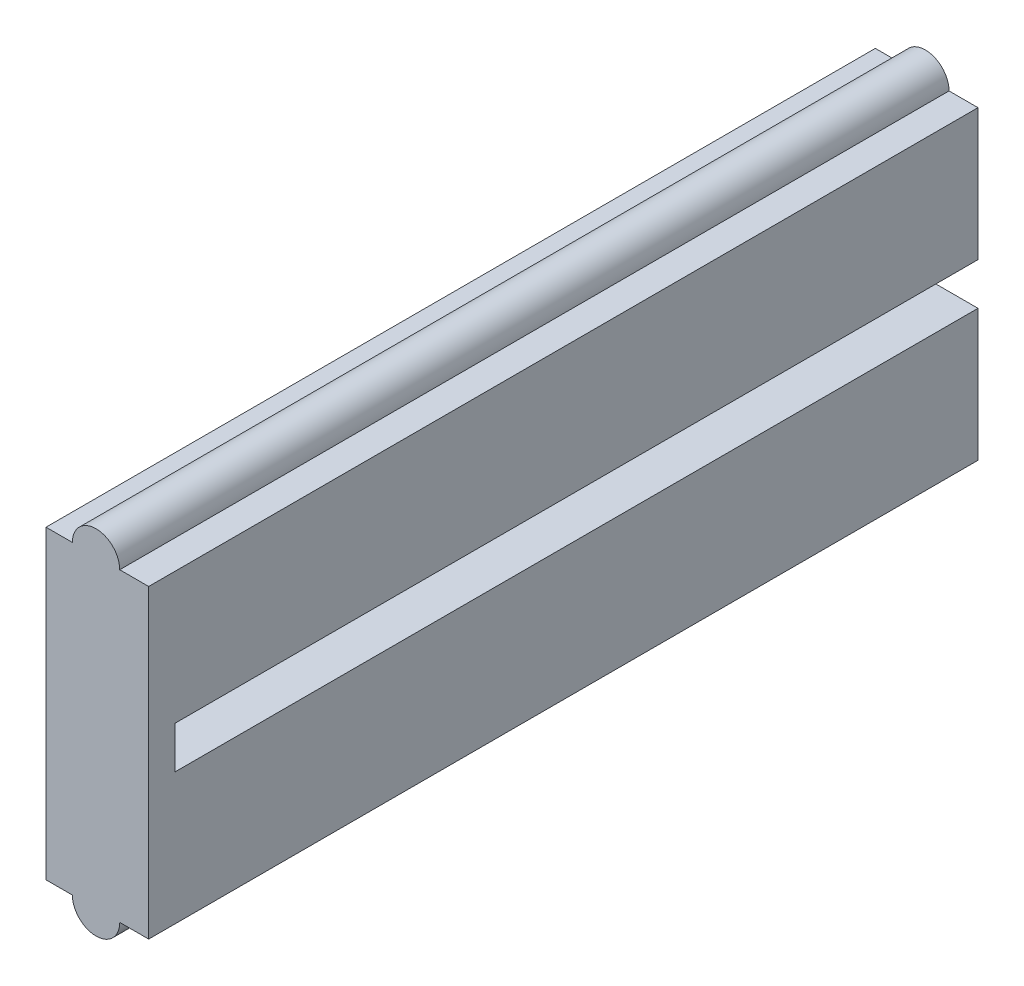
ISO-10303-21;
HEADER;
FILE_DESCRIPTION(('STEP AP214'),'2;1');
FILE_NAME('part.step','',(''),(''),'','','');
FILE_SCHEMA(('AUTOMOTIVE_DESIGN { 1 0 10303 214 1 1 1 1 }'));
ENDSEC;
DATA;
#1=APPLICATION_CONTEXT('core data for automotive mechanical design processes');
#2=APPLICATION_PROTOCOL_DEFINITION('international standard','automotive_design',2000,#1);
#3=PRODUCT_CONTEXT('',#1,'mechanical');
#4=PRODUCT('Part','Part','',(#3));
#5=PRODUCT_RELATED_PRODUCT_CATEGORY('part','',(#4));
#6=PRODUCT_DEFINITION_FORMATION('','',#4);
#7=PRODUCT_DEFINITION_CONTEXT('part definition',#1,'design');
#8=PRODUCT_DEFINITION('design','',#6,#7);
#9=PRODUCT_DEFINITION_SHAPE('','',#8);
#10=(LENGTH_UNIT() NAMED_UNIT(*) SI_UNIT(.MILLI.,.METRE.));
#11=(NAMED_UNIT(*) PLANE_ANGLE_UNIT() SI_UNIT($,.RADIAN.));
#12=(NAMED_UNIT(*) SI_UNIT($,.STERADIAN.) SOLID_ANGLE_UNIT());
#13=UNCERTAINTY_MEASURE_WITH_UNIT(LENGTH_MEASURE(1.E-05),#10,'distance_accuracy_value','');
#14=(GEOMETRIC_REPRESENTATION_CONTEXT(3) GLOBAL_UNCERTAINTY_ASSIGNED_CONTEXT((#13)) GLOBAL_UNIT_ASSIGNED_CONTEXT((#10,
#11,#12)) REPRESENTATION_CONTEXT('',''));
#15=CARTESIAN_POINT('',(0.,0.,0.));
#16=DIRECTION('',(0.,0.,1.));
#17=DIRECTION('',(1.,0.,0.));
#18=AXIS2_PLACEMENT_3D('',#15,#16,#17);
#19=CARTESIAN_POINT('',(-1.9,5.8,31.5));
#20=DIRECTION('',(1.,0.,0.));
#21=DIRECTION('',(0.,0.,-1.));
#22=AXIS2_PLACEMENT_3D('',#19,#20,#21);
#23=PLANE('',#22);
#24=DIRECTION('',(0.,-1.,0.));
#25=VECTOR('',#24,1.);
#26=CARTESIAN_POINT('',(-1.9,5.8,0.));
#27=LINE('',#26,#25);
#28=CARTESIAN_POINT('',(-1.9,5.8,0.));
#29=VERTEX_POINT('',#28);
#30=CARTESIAN_POINT('',(-1.9,-5.8,0.));
#31=VERTEX_POINT('',#30);
#32=EDGE_CURVE('E146',#29,#31,#27,.T.);
#33=ORIENTED_EDGE('',*,*,#32,.T.);
#34=DIRECTION('',(0.,0.,-1.));
#35=VECTOR('',#34,1.);
#36=CARTESIAN_POINT('',(-1.9,-5.8,31.5));
#37=LINE('',#36,#35);
#38=CARTESIAN_POINT('',(-1.9,-5.8,31.5));
#39=VERTEX_POINT('',#38);
#40=EDGE_CURVE('E11',#39,#31,#37,.T.);
#41=ORIENTED_EDGE('',*,*,#40,.F.);
#42=DIRECTION('',(0.,-1.,0.));
#43=VECTOR('',#42,1.);
#44=CARTESIAN_POINT('',(-1.9,5.8,31.5));
#45=LINE('',#44,#43);
#46=CARTESIAN_POINT('',(-1.9,5.8,31.5));
#47=VERTEX_POINT('',#46);
#48=EDGE_CURVE('E173',#47,#39,#45,.T.);
#49=ORIENTED_EDGE('',*,*,#48,.F.);
#50=DIRECTION('',(0.,0.,-1.));
#51=VECTOR('',#50,1.);
#52=CARTESIAN_POINT('',(-1.9,5.8,31.5));
#53=LINE('',#52,#51);
#54=EDGE_CURVE('E142',#47,#29,#53,.T.);
#55=ORIENTED_EDGE('',*,*,#54,.T.);
#56=EDGE_LOOP('',(#33,#41,#49,#55));
#57=FACE_BOUND('',#56,.T.);
#58=ADVANCED_FACE('F35',(#57),#23,.F.);
#59=CARTESIAN_POINT('',(-1.9,-5.8,31.5));
#60=DIRECTION('',(0.,1.,0.));
#61=DIRECTION('',(0.,0.,1.));
#62=AXIS2_PLACEMENT_3D('',#59,#60,#61);
#63=PLANE('',#62);
#64=DIRECTION('',(1.,0.,0.));
#65=VECTOR('',#64,1.);
#66=CARTESIAN_POINT('',(-1.9,-5.8,0.));
#67=LINE('',#66,#65);
#68=CARTESIAN_POINT('',(-0.897979589711327,-5.8,0.));
#69=VERTEX_POINT('',#68);
#70=EDGE_CURVE('E149',#31,#69,#67,.T.);
#71=ORIENTED_EDGE('',*,*,#70,.T.);
#72=DIRECTION('',(0.,0.,-1.));
#73=VECTOR('',#72,1.);
#74=CARTESIAN_POINT('',(-0.897979589711327,-5.8,31.5));
#75=LINE('',#74,#73);
#76=CARTESIAN_POINT('',(-0.897979589711327,-5.8,31.5));
#77=VERTEX_POINT('',#76);
#78=EDGE_CURVE('E43',#77,#69,#75,.T.);
#79=ORIENTED_EDGE('',*,*,#78,.F.);
#80=DIRECTION('',(1.,0.,0.));
#81=VECTOR('',#80,1.);
#82=CARTESIAN_POINT('',(-1.9,-5.8,31.5));
#83=LINE('',#82,#81);
#84=EDGE_CURVE('E107',#39,#77,#83,.T.);
#85=ORIENTED_EDGE('',*,*,#84,.F.);
#86=ORIENTED_EDGE('',*,*,#40,.T.);
#87=EDGE_LOOP('',(#71,#79,#85,#86));
#88=FACE_BOUND('',#87,.T.);
#89=ADVANCED_FACE('F263',(#88),#63,.F.);
#90=CARTESIAN_POINT('',(0.00202041028867306,-5.8,31.5));
#91=DIRECTION('',(0.,0.,-1.));
#92=DIRECTION('',(-1.,0.,0.));
#93=AXIS2_PLACEMENT_3D('',#90,#91,#92);
#94=CYLINDRICAL_SURFACE('',#93,0.9);
#95=CARTESIAN_POINT('',(0.00202041028867306,-5.8,0.));
#96=DIRECTION('',(0.,0.,1.));
#97=DIRECTION('',(-1.,0.,0.));
#98=AXIS2_PLACEMENT_3D('',#95,#96,#97);
#99=CIRCLE('',#98,0.9);
#100=CARTESIAN_POINT('',(0.902020410288673,-5.8,0.));
#101=VERTEX_POINT('',#100);
#102=EDGE_CURVE('E152',#69,#101,#99,.T.);
#103=ORIENTED_EDGE('',*,*,#102,.T.);
#104=DIRECTION('',(0.,0.,-1.));
#105=VECTOR('',#104,1.);
#106=CARTESIAN_POINT('',(0.902020410288673,-5.8,31.5));
#107=LINE('',#106,#105);
#108=CARTESIAN_POINT('',(0.902020410288673,-5.8,31.5));
#109=VERTEX_POINT('',#108);
#110=EDGE_CURVE('E188',#109,#101,#107,.T.);
#111=ORIENTED_EDGE('',*,*,#110,.F.);
#112=CARTESIAN_POINT('',(0.00202041028867306,-5.8,31.5));
#113=DIRECTION('',(0.,0.,1.));
#114=DIRECTION('',(-1.,0.,0.));
#115=AXIS2_PLACEMENT_3D('',#112,#113,#114);
#116=CIRCLE('',#115,0.9);
#117=EDGE_CURVE('E196',#77,#109,#116,.T.);
#118=ORIENTED_EDGE('',*,*,#117,.F.);
#119=ORIENTED_EDGE('',*,*,#78,.T.);
#120=EDGE_LOOP('',(#103,#111,#118,#119));
#121=FACE_BOUND('',#120,.T.);
#122=ADVANCED_FACE('F194',(#121),#94,.T.);
#123=CARTESIAN_POINT('',(0.902020410288673,-5.8,31.5));
#124=DIRECTION('',(0.,1.,0.));
#125=DIRECTION('',(-1.,0.,0.));
#126=AXIS2_PLACEMENT_3D('',#123,#124,#125);
#127=PLANE('',#126);
#128=DIRECTION('',(1.,0.,0.));
#129=VECTOR('',#128,1.);
#130=CARTESIAN_POINT('',(0.902020410288673,-5.8,0.));
#131=LINE('',#130,#129);
#132=CARTESIAN_POINT('',(2.,-5.8,0.));
#133=VERTEX_POINT('',#132);
#134=EDGE_CURVE('E154',#101,#133,#131,.T.);
#135=ORIENTED_EDGE('',*,*,#134,.T.);
#136=DIRECTION('',(0.,0.,-1.));
#137=VECTOR('',#136,1.);
#138=CARTESIAN_POINT('',(2.,-5.8,31.5));
#139=LINE('',#138,#137);
#140=CARTESIAN_POINT('',(2.,-5.8,31.5));
#141=VERTEX_POINT('',#140);
#142=EDGE_CURVE('E185',#141,#133,#139,.T.);
#143=ORIENTED_EDGE('',*,*,#142,.F.);
#144=DIRECTION('',(1.,0.,0.));
#145=VECTOR('',#144,1.);
#146=CARTESIAN_POINT('',(0.902020410288673,-5.8,31.5));
#147=LINE('',#146,#145);
#148=EDGE_CURVE('E210',#109,#141,#147,.T.);
#149=ORIENTED_EDGE('',*,*,#148,.F.);
#150=ORIENTED_EDGE('',*,*,#110,.T.);
#151=EDGE_LOOP('',(#135,#143,#149,#150));
#152=FACE_BOUND('',#151,.T.);
#153=ADVANCED_FACE('F205',(#152),#127,.F.);
#154=CARTESIAN_POINT('',(2.,-0.8,31.5));
#155=DIRECTION('',(0.,-1.,0.));
#156=DIRECTION('',(1.,0.,0.));
#157=AXIS2_PLACEMENT_3D('',#154,#155,#156);
#158=PLANE('',#157);
#159=DIRECTION('',(0.,0.,-1.));
#160=VECTOR('',#159,1.);
#161=CARTESIAN_POINT('',(0.,-0.8,31.5));
#162=LINE('',#161,#160);
#163=CARTESIAN_POINT('',(0.,-0.8,30.5));
#164=VERTEX_POINT('',#163);
#165=CARTESIAN_POINT('',(0.,-0.8,0.));
#166=VERTEX_POINT('',#165);
#167=EDGE_CURVE('E181',#164,#166,#162,.T.);
#168=ORIENTED_EDGE('',*,*,#167,.F.);
#169=DIRECTION('',(-1.,0.,0.));
#170=VECTOR('',#169,1.);
#171=CARTESIAN_POINT('',(0.00202041028867306,-0.8,30.5));
#172=LINE('',#171,#170);
#173=CARTESIAN_POINT('',(2.,-0.8,30.5));
#174=VERTEX_POINT('',#173);
#175=EDGE_CURVE('E218',#174,#164,#172,.T.);
#176=ORIENTED_EDGE('',*,*,#175,.F.);
#177=DIRECTION('',(0.,0.,-1.));
#178=VECTOR('',#177,1.);
#179=CARTESIAN_POINT('',(2.,-0.8,31.5));
#180=LINE('',#179,#178);
#181=CARTESIAN_POINT('',(2.,-0.8,0.));
#182=VERTEX_POINT('',#181);
#183=EDGE_CURVE('E183',#174,#182,#180,.T.);
#184=ORIENTED_EDGE('',*,*,#183,.T.);
#185=DIRECTION('',(-1.,0.,0.));
#186=VECTOR('',#185,1.);
#187=CARTESIAN_POINT('',(2.,-0.8,0.));
#188=LINE('',#187,#186);
#189=EDGE_CURVE('E159',#182,#166,#188,.T.);
#190=ORIENTED_EDGE('',*,*,#189,.T.);
#191=EDGE_LOOP('',(#168,#176,#184,#190));
#192=FACE_BOUND('',#191,.T.);
#193=ADVANCED_FACE('F245',(#192),#158,.F.);
#194=CARTESIAN_POINT('',(0.,0.8,31.5));
#195=DIRECTION('',(-1.,0.,0.));
#196=DIRECTION('',(0.,-1.,0.));
#197=AXIS2_PLACEMENT_3D('',#194,#195,#196);
#198=PLANE('',#197);
#199=DIRECTION('',(0.,0.,-1.));
#200=VECTOR('',#199,1.);
#201=CARTESIAN_POINT('',(0.,0.8,31.5));
#202=LINE('',#201,#200);
#203=CARTESIAN_POINT('',(0.,0.799999999999999,30.5));
#204=VERTEX_POINT('',#203);
#205=CARTESIAN_POINT('',(0.,0.8,0.));
#206=VERTEX_POINT('',#205);
#207=EDGE_CURVE('E179',#204,#206,#202,.T.);
#208=ORIENTED_EDGE('',*,*,#207,.F.);
#209=DIRECTION('',(0.,1.,0.));
#210=VECTOR('',#209,1.);
#211=CARTESIAN_POINT('',(0.,-5.8,30.5));
#212=LINE('',#211,#210);
#213=EDGE_CURVE('E150',#164,#204,#212,.T.);
#214=ORIENTED_EDGE('',*,*,#213,.F.);
#215=ORIENTED_EDGE('',*,*,#167,.T.);
#216=DIRECTION('',(0.,1.,0.));
#217=VECTOR('',#216,1.);
#218=CARTESIAN_POINT('',(0.,0.8,0.));
#219=LINE('',#218,#217);
#220=EDGE_CURVE('E162',#166,#206,#219,.T.);
#221=ORIENTED_EDGE('',*,*,#220,.T.);
#222=EDGE_LOOP('',(#208,#214,#215,#221));
#223=FACE_BOUND('',#222,.T.);
#224=ADVANCED_FACE('F248',(#223),#198,.F.);
#225=CARTESIAN_POINT('',(2.,0.8,31.5));
#226=DIRECTION('',(0.,1.,0.));
#227=DIRECTION('',(-1.,0.,0.));
#228=AXIS2_PLACEMENT_3D('',#225,#226,#227);
#229=PLANE('',#228);
#230=DIRECTION('',(0.,0.,-1.));
#231=VECTOR('',#230,1.);
#232=CARTESIAN_POINT('',(2.,0.8,31.5));
#233=LINE('',#232,#231);
#234=CARTESIAN_POINT('',(2.,0.799999999999999,30.5));
#235=VERTEX_POINT('',#234);
#236=CARTESIAN_POINT('',(2.,0.8,0.));
#237=VERTEX_POINT('',#236);
#238=EDGE_CURVE('E177',#235,#237,#233,.T.);
#239=ORIENTED_EDGE('',*,*,#238,.F.);
#240=DIRECTION('',(1.,0.,0.));
#241=VECTOR('',#240,1.);
#242=CARTESIAN_POINT('',(0.00202041028867306,0.799999999999999,30.5));
#243=LINE('',#242,#241);
#244=EDGE_CURVE('E224',#204,#235,#243,.T.);
#245=ORIENTED_EDGE('',*,*,#244,.F.);
#246=ORIENTED_EDGE('',*,*,#207,.T.);
#247=DIRECTION('',(1.,0.,0.));
#248=VECTOR('',#247,1.);
#249=CARTESIAN_POINT('',(2.,0.8,0.));
#250=LINE('',#249,#248);
#251=EDGE_CURVE('E165',#206,#237,#250,.T.);
#252=ORIENTED_EDGE('',*,*,#251,.T.);
#253=EDGE_LOOP('',(#239,#245,#246,#252));
#254=FACE_BOUND('',#253,.T.);
#255=ADVANCED_FACE('F238',(#254),#229,.F.);
#256=CARTESIAN_POINT('',(2.,5.8,31.5));
#257=DIRECTION('',(-1.,0.,0.));
#258=DIRECTION('',(0.,-1.,0.));
#259=AXIS2_PLACEMENT_3D('',#256,#257,#258);
#260=PLANE('',#259);
#261=DIRECTION('',(0.,1.,0.));
#262=VECTOR('',#261,1.);
#263=CARTESIAN_POINT('',(2.,5.8,0.));
#264=LINE('',#263,#262);
#265=CARTESIAN_POINT('',(2.,5.8,0.));
#266=VERTEX_POINT('',#265);
#267=EDGE_CURVE('E168',#237,#266,#264,.T.);
#268=ORIENTED_EDGE('',*,*,#267,.T.);
#269=DIRECTION('',(0.,0.,-1.));
#270=VECTOR('',#269,1.);
#271=CARTESIAN_POINT('',(2.,5.8,31.5));
#272=LINE('',#271,#270);
#273=CARTESIAN_POINT('',(2.,5.8,31.5));
#274=VERTEX_POINT('',#273);
#275=EDGE_CURVE('E137',#274,#266,#272,.T.);
#276=ORIENTED_EDGE('',*,*,#275,.F.);
#277=DIRECTION('',(0.,1.,0.));
#278=VECTOR('',#277,1.);
#279=CARTESIAN_POINT('',(2.,-0.8,31.5));
#280=LINE('',#279,#278);
#281=EDGE_CURVE('E128',#141,#274,#280,.T.);
#282=ORIENTED_EDGE('',*,*,#281,.F.);
#283=ORIENTED_EDGE('',*,*,#142,.T.);
#284=DIRECTION('',(0.,1.,0.));
#285=VECTOR('',#284,1.);
#286=CARTESIAN_POINT('',(2.,-0.8,0.));
#287=LINE('',#286,#285);
#288=EDGE_CURVE('E156',#133,#182,#287,.T.);
#289=ORIENTED_EDGE('',*,*,#288,.T.);
#290=ORIENTED_EDGE('',*,*,#183,.F.);
#291=DIRECTION('',(0.,-1.,0.));
#292=VECTOR('',#291,1.);
#293=CARTESIAN_POINT('',(2.,-5.8,30.5));
#294=LINE('',#293,#292);
#295=EDGE_CURVE('E221',#235,#174,#294,.T.);
#296=ORIENTED_EDGE('',*,*,#295,.F.);
#297=ORIENTED_EDGE('',*,*,#238,.T.);
#298=EDGE_LOOP('',(#268,#276,#282,#283,#289,#290,#296,#297));
#299=FACE_BOUND('',#298,.T.);
#300=ADVANCED_FACE('F208',(#299),#260,.F.);
#301=CARTESIAN_POINT('',(0.899999999999999,5.8,31.5));
#302=DIRECTION('',(0.,-1.,0.));
#303=DIRECTION('',(1.,0.,0.));
#304=AXIS2_PLACEMENT_3D('',#301,#302,#303);
#305=PLANE('',#304);
#306=DIRECTION('',(-1.,0.,0.));
#307=VECTOR('',#306,1.);
#308=CARTESIAN_POINT('',(0.899999999999999,5.8,0.));
#309=LINE('',#308,#307);
#310=CARTESIAN_POINT('',(0.899999999999999,5.8,0.));
#311=VERTEX_POINT('',#310);
#312=EDGE_CURVE('E136',#266,#311,#309,.T.);
#313=ORIENTED_EDGE('',*,*,#312,.T.);
#314=DIRECTION('',(0.,0.,-1.));
#315=VECTOR('',#314,1.);
#316=CARTESIAN_POINT('',(0.899999999999999,5.8,31.5));
#317=LINE('',#316,#315);
#318=CARTESIAN_POINT('',(0.899999999999999,5.8,31.5));
#319=VERTEX_POINT('',#318);
#320=EDGE_CURVE('E133',#319,#311,#317,.T.);
#321=ORIENTED_EDGE('',*,*,#320,.F.);
#322=DIRECTION('',(-1.,0.,0.));
#323=VECTOR('',#322,1.);
#324=CARTESIAN_POINT('',(0.899999999999999,5.8,31.5));
#325=LINE('',#324,#323);
#326=EDGE_CURVE('E122',#274,#319,#325,.T.);
#327=ORIENTED_EDGE('',*,*,#326,.F.);
#328=ORIENTED_EDGE('',*,*,#275,.T.);
#329=EDGE_LOOP('',(#313,#321,#327,#328));
#330=FACE_BOUND('',#329,.T.);
#331=ADVANCED_FACE('F134',(#330),#305,.F.);
#332=CARTESIAN_POINT('',(0.,5.8,31.5));
#333=DIRECTION('',(0.,0.,-1.));
#334=DIRECTION('',(-1.,0.,0.));
#335=AXIS2_PLACEMENT_3D('',#332,#333,#334);
#336=CYLINDRICAL_SURFACE('',#335,0.9);
#337=CARTESIAN_POINT('',(0.,5.8,0.));
#338=DIRECTION('',(0.,0.,1.));
#339=DIRECTION('',(-1.,0.,0.));
#340=AXIS2_PLACEMENT_3D('',#337,#338,#339);
#341=CIRCLE('',#340,0.9);
#342=CARTESIAN_POINT('',(-0.900000000000001,5.8,0.));
#343=VERTEX_POINT('',#342);
#344=EDGE_CURVE('E93',#311,#343,#341,.T.);
#345=ORIENTED_EDGE('',*,*,#344,.T.);
#346=DIRECTION('',(0.,0.,-1.));
#347=VECTOR('',#346,1.);
#348=CARTESIAN_POINT('',(-0.900000000000001,5.8,31.5));
#349=LINE('',#348,#347);
#350=CARTESIAN_POINT('',(-0.900000000000001,5.8,31.5));
#351=VERTEX_POINT('',#350);
#352=EDGE_CURVE('E138',#351,#343,#349,.T.);
#353=ORIENTED_EDGE('',*,*,#352,.F.);
#354=CARTESIAN_POINT('',(0.,5.8,31.5));
#355=DIRECTION('',(0.,0.,1.));
#356=DIRECTION('',(-1.,0.,0.));
#357=AXIS2_PLACEMENT_3D('',#354,#355,#356);
#358=CIRCLE('',#357,0.9);
#359=EDGE_CURVE('E126',#319,#351,#358,.T.);
#360=ORIENTED_EDGE('',*,*,#359,.F.);
#361=ORIENTED_EDGE('',*,*,#320,.T.);
#362=EDGE_LOOP('',(#345,#353,#360,#361));
#363=FACE_BOUND('',#362,.T.);
#364=ADVANCED_FACE('F140',(#363),#336,.T.);
#365=CARTESIAN_POINT('',(-1.9,5.8,31.5));
#366=DIRECTION('',(0.,-1.,0.));
#367=DIRECTION('',(0.,0.,-1.));
#368=AXIS2_PLACEMENT_3D('',#365,#366,#367);
#369=PLANE('',#368);
#370=DIRECTION('',(-1.,0.,0.));
#371=VECTOR('',#370,1.);
#372=CARTESIAN_POINT('',(-1.9,5.8,0.));
#373=LINE('',#372,#371);
#374=EDGE_CURVE('E99',#343,#29,#373,.T.);
#375=ORIENTED_EDGE('',*,*,#374,.T.);
#376=ORIENTED_EDGE('',*,*,#54,.F.);
#377=DIRECTION('',(-1.,0.,0.));
#378=VECTOR('',#377,1.);
#379=CARTESIAN_POINT('',(-1.9,5.8,31.5));
#380=LINE('',#379,#378);
#381=EDGE_CURVE('E51',#351,#47,#380,.T.);
#382=ORIENTED_EDGE('',*,*,#381,.F.);
#383=ORIENTED_EDGE('',*,*,#352,.T.);
#384=EDGE_LOOP('',(#375,#376,#382,#383));
#385=FACE_BOUND('',#384,.T.);
#386=ADVANCED_FACE('F252',(#385),#369,.F.);
#387=CARTESIAN_POINT('',(0.00202041028867306,-5.8,31.5));
#388=DIRECTION('',(0.,0.,-1.));
#389=DIRECTION('',(-1.,0.,0.));
#390=AXIS2_PLACEMENT_3D('',#387,#388,#389);
#391=PLANE('',#390);
#392=ORIENTED_EDGE('',*,*,#281,.T.);
#393=ORIENTED_EDGE('',*,*,#326,.T.);
#394=ORIENTED_EDGE('',*,*,#359,.T.);
#395=ORIENTED_EDGE('',*,*,#381,.T.);
#396=ORIENTED_EDGE('',*,*,#48,.T.);
#397=ORIENTED_EDGE('',*,*,#84,.T.);
#398=ORIENTED_EDGE('',*,*,#117,.T.);
#399=ORIENTED_EDGE('',*,*,#148,.T.);
#400=EDGE_LOOP('',(#392,#393,#394,#395,#396,#397,#398,#399));
#401=FACE_BOUND('',#400,.T.);
#402=ADVANCED_FACE('F124',(#401),#391,.F.);
#403=CARTESIAN_POINT('',(0.00202041028867306,-5.8,0.));
#404=DIRECTION('',(0.,0.,-1.));
#405=DIRECTION('',(-1.,0.,0.));
#406=AXIS2_PLACEMENT_3D('',#403,#404,#405);
#407=PLANE('',#406);
#408=ORIENTED_EDGE('',*,*,#32,.F.);
#409=ORIENTED_EDGE('',*,*,#374,.F.);
#410=ORIENTED_EDGE('',*,*,#344,.F.);
#411=ORIENTED_EDGE('',*,*,#312,.F.);
#412=ORIENTED_EDGE('',*,*,#267,.F.);
#413=ORIENTED_EDGE('',*,*,#251,.F.);
#414=ORIENTED_EDGE('',*,*,#220,.F.);
#415=ORIENTED_EDGE('',*,*,#189,.F.);
#416=ORIENTED_EDGE('',*,*,#288,.F.);
#417=ORIENTED_EDGE('',*,*,#134,.F.);
#418=ORIENTED_EDGE('',*,*,#102,.F.);
#419=ORIENTED_EDGE('',*,*,#70,.F.);
#420=EDGE_LOOP('',(#408,#409,#410,#411,#412,#413,#414,#415,#416,#417,#418,#419));
#421=FACE_BOUND('',#420,.T.);
#422=ADVANCED_FACE('F200',(#421),#407,.T.);
#423=CARTESIAN_POINT('',(0.,0.,30.5));
#424=DIRECTION('',(0.,0.,-1.));
#425=DIRECTION('',(-1.,0.,0.));
#426=AXIS2_PLACEMENT_3D('',#423,#424,#425);
#427=PLANE('',#426);
#428=ORIENTED_EDGE('',*,*,#244,.T.);
#429=ORIENTED_EDGE('',*,*,#295,.T.);
#430=ORIENTED_EDGE('',*,*,#175,.T.);
#431=ORIENTED_EDGE('',*,*,#213,.T.);
#432=EDGE_LOOP('',(#428,#429,#430,#431));
#433=FACE_BOUND('',#432,.T.);
#434=ADVANCED_FACE('F230',(#433),#427,.T.);
#435=CLOSED_SHELL('',(#58,#89,#122,#153,#193,#224,#255,#300,#331,#364,#386,#402,#422,#434));
#436=MANIFOLD_SOLID_BREP('B2',#435);
#437=ADVANCED_BREP_SHAPE_REPRESENTATION('',(#18,#436),#14);
#438=SHAPE_DEFINITION_REPRESENTATION(#9,#437);
ENDSEC;
END-ISO-10303-21;
